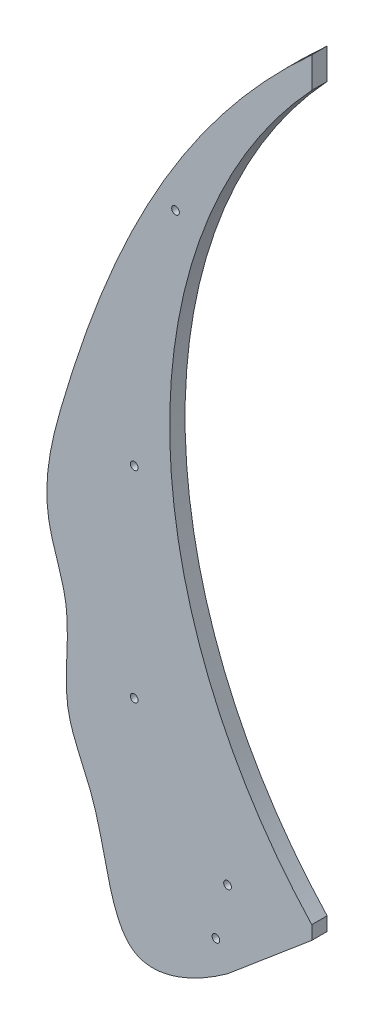
ISO-10303-21;
HEADER;
FILE_DESCRIPTION(('STEP AP214'),'2;1');
FILE_NAME('part.step','',(''),(''),'','','');
FILE_SCHEMA(('AUTOMOTIVE_DESIGN { 1 0 10303 214 1 1 1 1 }'));
ENDSEC;
DATA;
#1=APPLICATION_CONTEXT('core data for automotive mechanical design processes');
#2=APPLICATION_PROTOCOL_DEFINITION('international standard','automotive_design',2000,#1);
#3=PRODUCT_CONTEXT('',#1,'mechanical');
#4=PRODUCT('Part','Part','',(#3));
#5=PRODUCT_RELATED_PRODUCT_CATEGORY('part','',(#4));
#6=PRODUCT_DEFINITION_FORMATION('','',#4);
#7=PRODUCT_DEFINITION_CONTEXT('part definition',#1,'design');
#8=PRODUCT_DEFINITION('design','',#6,#7);
#9=PRODUCT_DEFINITION_SHAPE('','',#8);
#10=(LENGTH_UNIT() NAMED_UNIT(*) SI_UNIT(.MILLI.,.METRE.));
#11=(NAMED_UNIT(*) PLANE_ANGLE_UNIT() SI_UNIT($,.RADIAN.));
#12=(NAMED_UNIT(*) SI_UNIT($,.STERADIAN.) SOLID_ANGLE_UNIT());
#13=UNCERTAINTY_MEASURE_WITH_UNIT(LENGTH_MEASURE(1.E-05),#10,'distance_accuracy_value','');
#14=(GEOMETRIC_REPRESENTATION_CONTEXT(3) GLOBAL_UNCERTAINTY_ASSIGNED_CONTEXT((#13)) GLOBAL_UNIT_ASSIGNED_CONTEXT((#10,
#11,#12)) REPRESENTATION_CONTEXT('',''));
#15=CARTESIAN_POINT('',(0.,0.,0.));
#16=DIRECTION('',(0.,0.,1.));
#17=DIRECTION('',(1.,0.,0.));
#18=AXIS2_PLACEMENT_3D('',#15,#16,#17);
#19=CARTESIAN_POINT('',(252.586618806302,235.,10.));
#20=DIRECTION('',(0.,0.,-1.));
#21=DIRECTION('',(-1.,0.,0.));
#22=AXIS2_PLACEMENT_3D('',#19,#20,#21);
#23=PLANE('',#22);
#24=CARTESIAN_POINT('',(252.586618806302,235.,10.));
#25=DIRECTION('',(0.,0.,-1.));
#26=DIRECTION('',(-1.,0.,0.));
#27=AXIS2_PLACEMENT_3D('',#24,#25,#26);
#28=CIRCLE('',#27,345.);
#29=CARTESIAN_POINT('',(0.,0.,10.));
#30=VERTEX_POINT('',#29);
#31=CARTESIAN_POINT('',(0.,470.,10.));
#32=VERTEX_POINT('',#31);
#33=EDGE_CURVE('E125',#30,#32,#28,.T.);
#34=ORIENTED_EDGE('',*,*,#33,.T.);
#35=DIRECTION('',(0.,1.,0.));
#36=VECTOR('',#35,1.);
#37=CARTESIAN_POINT('',(0.,490.,10.));
#38=LINE('',#37,#36);
#39=CARTESIAN_POINT('',(0.,490.,10.));
#40=VERTEX_POINT('',#39);
#41=EDGE_CURVE('E84',#32,#40,#38,.T.);
#42=ORIENTED_EDGE('',*,*,#41,.T.);
#43=CARTESIAN_POINT('',(0.,490.,10.));
#44=CARTESIAN_POINT('',(-83.9880632432661,413.799917364868,10.));
#45=CARTESIAN_POINT('',(-140.629316159284,299.758982487462,10.));
#46=CARTESIAN_POINT('',(-178.978394968214,151.156197499007,10.));
#47=CARTESIAN_POINT('',(-153.216703703767,95.6287293786955,10.));
#48=CARTESIAN_POINT('',(-166.063985478132,44.0139208701114,10.));
#49=CARTESIAN_POINT('',(-133.749361854705,-8.32312133536127,10.));
#50=CARTESIAN_POINT('',(-130.437818624515,-93.1255335906909,10.));
#51=CARTESIAN_POINT('',(-77.500010103612,-71.4105424326423,10.));
#52=CARTESIAN_POINT('',(-54.7153965629253,-55.,10.));
#53=B_SPLINE_CURVE_WITH_KNOTS('',3,(#43,#44,#45,#46,#47,#48,#49,#50,#51,#52),.UNSPECIFIED.,.F.,
.F.,(4,1,1,1,1,1,1,4),(0.10149707906668,0.522601058515196,0.622188190019839,0.671922063733112,
0.7554083503048,0.810597974533968,0.915937455376124,1.),.UNSPECIFIED.);
#54=CARTESIAN_POINT('',(-54.7153965629253,-55.,10.));
#55=VERTEX_POINT('',#54);
#56=EDGE_CURVE('E88',#40,#55,#53,.T.);
#57=ORIENTED_EDGE('',*,*,#56,.T.);
#58=DIRECTION('',(0.764524789401273,0.644594326992519,0.));
#59=VECTOR('',#58,1.);
#60=CARTESIAN_POINT('',(0.,-8.86776895589186,10.));
#61=LINE('',#60,#59);
#62=CARTESIAN_POINT('',(0.,-8.86776895589186,10.));
#63=VERTEX_POINT('',#62);
#64=EDGE_CURVE('E92',#55,#63,#61,.T.);
#65=ORIENTED_EDGE('',*,*,#64,.T.);
#66=DIRECTION('',(0.,1.,0.));
#67=VECTOR('',#66,1.);
#68=CARTESIAN_POINT('',(0.,0.,10.));
#69=LINE('',#68,#67);
#70=EDGE_CURVE('E50',#63,#30,#69,.T.);
#71=ORIENTED_EDGE('',*,*,#70,.T.);
#72=EDGE_LOOP('',(#34,#42,#57,#65,#71));
#73=FACE_BOUND('',#72,.T.);
#74=CARTESIAN_POINT('',(-54.7722557505166,-5.,10.));
#75=DIRECTION('',(0.,0.,1.));
#76=DIRECTION('',(1.,0.,0.));
#77=AXIS2_PLACEMENT_3D('',#74,#75,#76);
#78=CIRCLE('',#77,2.5);
#79=CARTESIAN_POINT('',(-52.2722557505166,-5.,10.));
#80=VERTEX_POINT('',#79);
#81=EDGE_CURVE('E115',#80,#80,#78,.T.);
#82=ORIENTED_EDGE('',*,*,#81,.F.);
#83=EDGE_LOOP('',(#82));
#84=FACE_BOUND('',#83,.T.);
#85=CARTESIAN_POINT('',(-115.495699516938,69.8074465975367,10.));
#86=DIRECTION('',(0.,0.,1.));
#87=DIRECTION('',(1.,0.,0.));
#88=AXIS2_PLACEMENT_3D('',#85,#86,#87);
#89=CIRCLE('',#88,2.5);
#90=CARTESIAN_POINT('',(-112.995699516938,69.8074465975367,10.));
#91=VERTEX_POINT('',#90);
#92=EDGE_CURVE('E194',#91,#91,#89,.T.);
#93=ORIENTED_EDGE('',*,*,#92,.F.);
#94=EDGE_LOOP('',(#93));
#95=FACE_BOUND('',#94,.T.);
#96=CARTESIAN_POINT('',(-62.3594052033568,-38.8939193309459,10.));
#97=DIRECTION('',(0.,0.,1.));
#98=DIRECTION('',(1.,0.,0.));
#99=AXIS2_PLACEMENT_3D('',#96,#97,#98);
#100=CIRCLE('',#99,2.5);
#101=CARTESIAN_POINT('',(-59.8594052033568,-38.8939193309459,10.));
#102=VERTEX_POINT('',#101);
#103=EDGE_CURVE('E188',#102,#102,#100,.T.);
#104=ORIENTED_EDGE('',*,*,#103,.F.);
#105=EDGE_LOOP('',(#104));
#106=FACE_BOUND('',#105,.T.);
#107=CARTESIAN_POINT('',(-115.495699516938,200.727236705411,10.));
#108=DIRECTION('',(0.,0.,1.));
#109=DIRECTION('',(1.,0.,0.));
#110=AXIS2_PLACEMENT_3D('',#107,#108,#109);
#111=CIRCLE('',#110,2.5);
#112=CARTESIAN_POINT('',(-112.995699516938,200.727236705411,10.));
#113=VERTEX_POINT('',#112);
#114=EDGE_CURVE('E182',#113,#113,#111,.T.);
#115=ORIENTED_EDGE('',*,*,#114,.F.);
#116=EDGE_LOOP('',(#115));
#117=FACE_BOUND('',#116,.T.);
#118=CARTESIAN_POINT('',(-88.6059033443942,358.102068824816,10.));
#119=DIRECTION('',(0.,0.,1.));
#120=DIRECTION('',(1.,0.,0.));
#121=AXIS2_PLACEMENT_3D('',#118,#119,#120);
#122=CIRCLE('',#121,2.5);
#123=CARTESIAN_POINT('',(-86.1059033443942,358.102068824816,10.));
#124=VERTEX_POINT('',#123);
#125=EDGE_CURVE('E173',#124,#124,#122,.T.);
#126=ORIENTED_EDGE('',*,*,#125,.F.);
#127=EDGE_LOOP('',(#126));
#128=FACE_BOUND('',#127,.T.);
#129=ADVANCED_FACE('F33',(#73,#84,#95,#106,#117,#128),#23,.F.);
#130=CARTESIAN_POINT('',(252.586618806302,235.,0.));
#131=DIRECTION('',(0.,0.,-1.));
#132=DIRECTION('',(-1.,0.,0.));
#133=AXIS2_PLACEMENT_3D('',#130,#131,#132);
#134=PLANE('',#133);
#135=CARTESIAN_POINT('',(-115.495699516938,200.727236705411,0.));
#136=DIRECTION('',(0.,0.,1.));
#137=DIRECTION('',(1.,0.,0.));
#138=AXIS2_PLACEMENT_3D('',#135,#136,#137);
#139=CIRCLE('',#138,2.5);
#140=CARTESIAN_POINT('',(-112.995699516938,200.727236705411,0.));
#141=VERTEX_POINT('',#140);
#142=EDGE_CURVE('E179',#141,#141,#139,.T.);
#143=ORIENTED_EDGE('',*,*,#142,.T.);
#144=EDGE_LOOP('',(#143));
#145=FACE_BOUND('',#144,.T.);
#146=CARTESIAN_POINT('',(-115.495699516938,69.8074465975367,0.));
#147=DIRECTION('',(0.,0.,1.));
#148=DIRECTION('',(1.,0.,0.));
#149=AXIS2_PLACEMENT_3D('',#146,#147,#148);
#150=CIRCLE('',#149,2.5);
#151=CARTESIAN_POINT('',(-112.995699516938,69.8074465975367,0.));
#152=VERTEX_POINT('',#151);
#153=EDGE_CURVE('E191',#152,#152,#150,.T.);
#154=ORIENTED_EDGE('',*,*,#153,.T.);
#155=EDGE_LOOP('',(#154));
#156=FACE_BOUND('',#155,.T.);
#157=CARTESIAN_POINT('',(252.586618806302,235.,0.));
#158=DIRECTION('',(0.,0.,-1.));
#159=DIRECTION('',(-1.,0.,0.));
#160=AXIS2_PLACEMENT_3D('',#157,#158,#159);
#161=CIRCLE('',#160,345.);
#162=CARTESIAN_POINT('',(0.,0.,0.));
#163=VERTEX_POINT('',#162);
#164=CARTESIAN_POINT('',(0.,470.,0.));
#165=VERTEX_POINT('',#164);
#166=EDGE_CURVE('E111',#163,#165,#161,.T.);
#167=ORIENTED_EDGE('',*,*,#166,.F.);
#168=DIRECTION('',(0.,1.,0.));
#169=VECTOR('',#168,1.);
#170=CARTESIAN_POINT('',(0.,0.,0.));
#171=LINE('',#170,#169);
#172=CARTESIAN_POINT('',(0.,-8.86776895589186,0.));
#173=VERTEX_POINT('',#172);
#174=EDGE_CURVE('E76',#173,#163,#171,.T.);
#175=ORIENTED_EDGE('',*,*,#174,.F.);
#176=DIRECTION('',(0.764524789401273,0.644594326992519,0.));
#177=VECTOR('',#176,1.);
#178=CARTESIAN_POINT('',(0.,-8.86776895589186,0.));
#179=LINE('',#178,#177);
#180=CARTESIAN_POINT('',(-54.7153965629253,-55.,0.));
#181=VERTEX_POINT('',#180);
#182=EDGE_CURVE('E70',#181,#173,#179,.T.);
#183=ORIENTED_EDGE('',*,*,#182,.F.);
#184=CARTESIAN_POINT('',(0.,490.,0.));
#185=CARTESIAN_POINT('',(-83.9880632432661,413.799917364868,0.));
#186=CARTESIAN_POINT('',(-140.629316159284,299.758982487462,0.));
#187=CARTESIAN_POINT('',(-178.978394968214,151.156197499007,0.));
#188=CARTESIAN_POINT('',(-153.216703703767,95.6287293786955,0.));
#189=CARTESIAN_POINT('',(-166.063985478132,44.0139208701114,0.));
#190=CARTESIAN_POINT('',(-133.749361854705,-8.32312133536127,0.));
#191=CARTESIAN_POINT('',(-130.437818624515,-93.1255335906909,0.));
#192=CARTESIAN_POINT('',(-77.500010103612,-71.4105424326423,0.));
#193=CARTESIAN_POINT('',(-54.7153965629253,-55.,0.));
#194=B_SPLINE_CURVE_WITH_KNOTS('',3,(#184,#185,#186,#187,#188,#189,#190,#191,#192,#193),
.UNSPECIFIED.,.F.,.F.,(4,1,1,1,1,1,1,4),(0.10149707906668,0.522601058515196,0.622188190019839,
0.671922063733112,0.7554083503048,0.810597974533968,0.915937455376124,1.),.UNSPECIFIED.);
#195=CARTESIAN_POINT('',(0.,490.,0.));
#196=VERTEX_POINT('',#195);
#197=EDGE_CURVE('E99',#196,#181,#194,.T.);
#198=ORIENTED_EDGE('',*,*,#197,.F.);
#199=DIRECTION('',(0.,1.,0.));
#200=VECTOR('',#199,1.);
#201=CARTESIAN_POINT('',(0.,490.,0.));
#202=LINE('',#201,#200);
#203=EDGE_CURVE('E114',#165,#196,#202,.T.);
#204=ORIENTED_EDGE('',*,*,#203,.F.);
#205=EDGE_LOOP('',(#167,#175,#183,#198,#204));
#206=FACE_BOUND('',#205,.T.);
#207=CARTESIAN_POINT('',(-54.7722557505166,-5.,0.));
#208=DIRECTION('',(0.,0.,1.));
#209=DIRECTION('',(1.,0.,0.));
#210=AXIS2_PLACEMENT_3D('',#207,#208,#209);
#211=CIRCLE('',#210,2.5);
#212=CARTESIAN_POINT('',(-52.2722557505166,-5.,0.));
#213=VERTEX_POINT('',#212);
#214=EDGE_CURVE('E197',#213,#213,#211,.T.);
#215=ORIENTED_EDGE('',*,*,#214,.T.);
#216=EDGE_LOOP('',(#215));
#217=FACE_BOUND('',#216,.T.);
#218=CARTESIAN_POINT('',(-62.3594052033568,-38.8939193309459,0.));
#219=DIRECTION('',(0.,0.,1.));
#220=DIRECTION('',(1.,0.,0.));
#221=AXIS2_PLACEMENT_3D('',#218,#219,#220);
#222=CIRCLE('',#221,2.5);
#223=CARTESIAN_POINT('',(-59.8594052033568,-38.8939193309459,0.));
#224=VERTEX_POINT('',#223);
#225=EDGE_CURVE('E185',#224,#224,#222,.T.);
#226=ORIENTED_EDGE('',*,*,#225,.T.);
#227=EDGE_LOOP('',(#226));
#228=FACE_BOUND('',#227,.T.);
#229=CARTESIAN_POINT('',(-88.6059033443942,358.102068824816,0.));
#230=DIRECTION('',(0.,0.,1.));
#231=DIRECTION('',(1.,0.,0.));
#232=AXIS2_PLACEMENT_3D('',#229,#230,#231);
#233=CIRCLE('',#232,2.5);
#234=CARTESIAN_POINT('',(-86.1059033443942,358.102068824816,0.));
#235=VERTEX_POINT('',#234);
#236=EDGE_CURVE('E176',#235,#235,#233,.T.);
#237=ORIENTED_EDGE('',*,*,#236,.T.);
#238=EDGE_LOOP('',(#237));
#239=FACE_BOUND('',#238,.T.);
#240=ADVANCED_FACE('F129',(#145,#156,#206,#217,#228,#239),#134,.T.);
#241=CARTESIAN_POINT('',(252.586618806302,235.,10.));
#242=DIRECTION('',(0.,0.,-1.));
#243=DIRECTION('',(-1.,0.,0.));
#244=AXIS2_PLACEMENT_3D('',#241,#242,#243);
#245=CYLINDRICAL_SURFACE('',#244,345.);
#246=ORIENTED_EDGE('',*,*,#166,.T.);
#247=DIRECTION('',(0.,0.,-1.));
#248=VECTOR('',#247,1.);
#249=CARTESIAN_POINT('',(0.,470.,10.));
#250=LINE('',#249,#248);
#251=EDGE_CURVE('E11',#32,#165,#250,.T.);
#252=ORIENTED_EDGE('',*,*,#251,.F.);
#253=ORIENTED_EDGE('',*,*,#33,.F.);
#254=DIRECTION('',(0.,0.,-1.));
#255=VECTOR('',#254,1.);
#256=CARTESIAN_POINT('',(0.,0.,10.));
#257=LINE('',#256,#255);
#258=EDGE_CURVE('E104',#30,#163,#257,.T.);
#259=ORIENTED_EDGE('',*,*,#258,.T.);
#260=EDGE_LOOP('',(#246,#252,#253,#259));
#261=FACE_BOUND('',#260,.T.);
#262=ADVANCED_FACE('F35',(#261),#245,.F.);
#263=CARTESIAN_POINT('',(0.,490.,10.));
#264=DIRECTION('',(-1.,0.,0.));
#265=DIRECTION('',(0.,-1.,0.));
#266=AXIS2_PLACEMENT_3D('',#263,#264,#265);
#267=PLANE('',#266);
#268=ORIENTED_EDGE('',*,*,#203,.T.);
#269=DIRECTION('',(0.,0.,-1.));
#270=VECTOR('',#269,1.);
#271=CARTESIAN_POINT('',(0.,490.,10.));
#272=LINE('',#271,#270);
#273=EDGE_CURVE('E42',#40,#196,#272,.T.);
#274=ORIENTED_EDGE('',*,*,#273,.F.);
#275=ORIENTED_EDGE('',*,*,#41,.F.);
#276=ORIENTED_EDGE('',*,*,#251,.T.);
#277=EDGE_LOOP('',(#268,#274,#275,#276));
#278=FACE_BOUND('',#277,.T.);
#279=ADVANCED_FACE('F257',(#278),#267,.F.);
#280=DIRECTION('',(0.,0.,-1.));
#281=VECTOR('',#280,1.);
#282=SURFACE_OF_LINEAR_EXTRUSION('',#53,#281);
#283=ORIENTED_EDGE('',*,*,#197,.T.);
#284=DIRECTION('',(0.,0.,-1.));
#285=VECTOR('',#284,1.);
#286=CARTESIAN_POINT('',(-54.7153965629253,-55.,10.));
#287=LINE('',#286,#285);
#288=EDGE_CURVE('E96',#55,#181,#287,.T.);
#289=ORIENTED_EDGE('',*,*,#288,.F.);
#290=ORIENTED_EDGE('',*,*,#56,.F.);
#291=ORIENTED_EDGE('',*,*,#273,.T.);
#292=EDGE_LOOP('',(#283,#289,#290,#291));
#293=FACE_BOUND('',#292,.T.);
#294=ADVANCED_FACE('F97',(#293),#282,.F.);
#295=CARTESIAN_POINT('',(0.,-8.86776895589186,10.));
#296=DIRECTION('',(-0.644594326992519,0.764524789401273,0.));
#297=DIRECTION('',(-0.764524789401273,-0.644594326992519,0.));
#298=AXIS2_PLACEMENT_3D('',#295,#296,#297);
#299=PLANE('',#298);
#300=ORIENTED_EDGE('',*,*,#182,.T.);
#301=DIRECTION('',(0.,0.,-1.));
#302=VECTOR('',#301,1.);
#303=CARTESIAN_POINT('',(0.,-8.86776895589186,10.));
#304=LINE('',#303,#302);
#305=EDGE_CURVE('E100',#63,#173,#304,.T.);
#306=ORIENTED_EDGE('',*,*,#305,.F.);
#307=ORIENTED_EDGE('',*,*,#64,.F.);
#308=ORIENTED_EDGE('',*,*,#288,.T.);
#309=EDGE_LOOP('',(#300,#306,#307,#308));
#310=FACE_BOUND('',#309,.T.);
#311=ADVANCED_FACE('F102',(#310),#299,.F.);
#312=CARTESIAN_POINT('',(0.,0.,10.));
#313=DIRECTION('',(-1.,0.,0.));
#314=DIRECTION('',(0.,0.,1.));
#315=AXIS2_PLACEMENT_3D('',#312,#313,#314);
#316=PLANE('',#315);
#317=ORIENTED_EDGE('',*,*,#174,.T.);
#318=ORIENTED_EDGE('',*,*,#258,.F.);
#319=ORIENTED_EDGE('',*,*,#70,.F.);
#320=ORIENTED_EDGE('',*,*,#305,.T.);
#321=EDGE_LOOP('',(#317,#318,#319,#320));
#322=FACE_BOUND('',#321,.T.);
#323=ADVANCED_FACE('F134',(#322),#316,.F.);
#324=CARTESIAN_POINT('',(-54.7722557505166,-5.,10.));
#325=DIRECTION('',(0.,0.,-1.));
#326=DIRECTION('',(-1.,0.,0.));
#327=AXIS2_PLACEMENT_3D('',#324,#325,#326);
#328=CYLINDRICAL_SURFACE('',#327,2.5);
#329=ORIENTED_EDGE('',*,*,#81,.T.);
#330=EDGE_LOOP('',(#329));
#331=FACE_BOUND('',#330,.T.);
#332=ORIENTED_EDGE('',*,*,#214,.F.);
#333=EDGE_LOOP('',(#332));
#334=FACE_BOUND('',#333,.T.);
#335=ADVANCED_FACE('F136',(#331,#334),#328,.F.);
#336=CARTESIAN_POINT('',(-115.495699516938,69.8074465975367,10.));
#337=DIRECTION('',(0.,0.,-1.));
#338=DIRECTION('',(-1.,0.,0.));
#339=AXIS2_PLACEMENT_3D('',#336,#337,#338);
#340=CYLINDRICAL_SURFACE('',#339,2.5);
#341=ORIENTED_EDGE('',*,*,#92,.T.);
#342=EDGE_LOOP('',(#341));
#343=FACE_BOUND('',#342,.T.);
#344=ORIENTED_EDGE('',*,*,#153,.F.);
#345=EDGE_LOOP('',(#344));
#346=FACE_BOUND('',#345,.T.);
#347=ADVANCED_FACE('F142',(#343,#346),#340,.F.);
#348=CARTESIAN_POINT('',(-62.3594052033568,-38.8939193309459,10.));
#349=DIRECTION('',(0.,0.,-1.));
#350=DIRECTION('',(-1.,0.,0.));
#351=AXIS2_PLACEMENT_3D('',#348,#349,#350);
#352=CYLINDRICAL_SURFACE('',#351,2.5);
#353=ORIENTED_EDGE('',*,*,#103,.T.);
#354=EDGE_LOOP('',(#353));
#355=FACE_BOUND('',#354,.T.);
#356=ORIENTED_EDGE('',*,*,#225,.F.);
#357=EDGE_LOOP('',(#356));
#358=FACE_BOUND('',#357,.T.);
#359=ADVANCED_FACE('F156',(#355,#358),#352,.F.);
#360=CARTESIAN_POINT('',(-115.495699516938,200.727236705411,10.));
#361=DIRECTION('',(0.,0.,-1.));
#362=DIRECTION('',(-1.,0.,0.));
#363=AXIS2_PLACEMENT_3D('',#360,#361,#362);
#364=CYLINDRICAL_SURFACE('',#363,2.5);
#365=ORIENTED_EDGE('',*,*,#114,.T.);
#366=EDGE_LOOP('',(#365));
#367=FACE_BOUND('',#366,.T.);
#368=ORIENTED_EDGE('',*,*,#142,.F.);
#369=EDGE_LOOP('',(#368));
#370=FACE_BOUND('',#369,.T.);
#371=ADVANCED_FACE('F160',(#367,#370),#364,.F.);
#372=CARTESIAN_POINT('',(-88.6059033443942,358.102068824816,10.));
#373=DIRECTION('',(0.,0.,-1.));
#374=DIRECTION('',(-1.,0.,0.));
#375=AXIS2_PLACEMENT_3D('',#372,#373,#374);
#376=CYLINDRICAL_SURFACE('',#375,2.5);
#377=ORIENTED_EDGE('',*,*,#125,.T.);
#378=EDGE_LOOP('',(#377));
#379=FACE_BOUND('',#378,.T.);
#380=ORIENTED_EDGE('',*,*,#236,.F.);
#381=EDGE_LOOP('',(#380));
#382=FACE_BOUND('',#381,.T.);
#383=ADVANCED_FACE('F164',(#379,#382),#376,.F.);
#384=CLOSED_SHELL('',(#129,#240,#262,#279,#294,#311,#323,#335,#347,#359,#371,#383));
#385=MANIFOLD_SOLID_BREP('B2',#384);
#386=ADVANCED_BREP_SHAPE_REPRESENTATION('',(#18,#385),#14);
#387=SHAPE_DEFINITION_REPRESENTATION(#9,#386);
ENDSEC;
END-ISO-10303-21;
